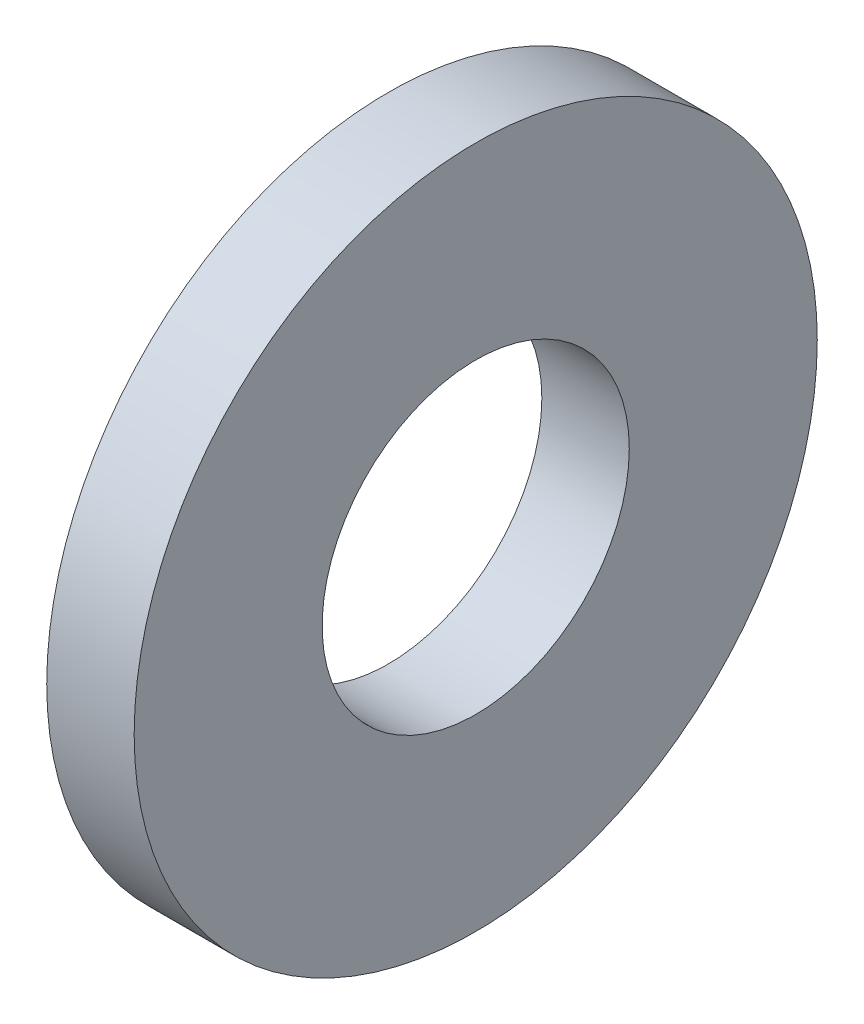
ISO-10303-21;
HEADER;
FILE_DESCRIPTION(('STEP AP214'),'2;1');
FILE_NAME('part.step','',(''),(''),'','','');
FILE_SCHEMA(('AUTOMOTIVE_DESIGN { 1 0 10303 214 1 1 1 1 }'));
ENDSEC;
DATA;
#1=APPLICATION_CONTEXT('core data for automotive mechanical design processes');
#2=APPLICATION_PROTOCOL_DEFINITION('international standard','automotive_design',2000,#1);
#3=PRODUCT_CONTEXT('',#1,'mechanical');
#4=PRODUCT('Part','Part','',(#3));
#5=PRODUCT_RELATED_PRODUCT_CATEGORY('part','',(#4));
#6=PRODUCT_DEFINITION_FORMATION('','',#4);
#7=PRODUCT_DEFINITION_CONTEXT('part definition',#1,'design');
#8=PRODUCT_DEFINITION('design','',#6,#7);
#9=PRODUCT_DEFINITION_SHAPE('','',#8);
#10=(LENGTH_UNIT() NAMED_UNIT(*) SI_UNIT(.MILLI.,.METRE.));
#11=(NAMED_UNIT(*) PLANE_ANGLE_UNIT() SI_UNIT($,.RADIAN.));
#12=(NAMED_UNIT(*) SI_UNIT($,.STERADIAN.) SOLID_ANGLE_UNIT());
#13=UNCERTAINTY_MEASURE_WITH_UNIT(LENGTH_MEASURE(1.E-05),#10,'distance_accuracy_value','');
#14=(GEOMETRIC_REPRESENTATION_CONTEXT(3) GLOBAL_UNCERTAINTY_ASSIGNED_CONTEXT((#13)) GLOBAL_UNIT_ASSIGNED_CONTEXT((#10,
#11,#12)) REPRESENTATION_CONTEXT('',''));
#15=CARTESIAN_POINT('',(0.,0.,0.));
#16=DIRECTION('',(0.,0.,1.));
#17=DIRECTION('',(1.,0.,0.));
#18=AXIS2_PLACEMENT_3D('',#15,#16,#17);
#19=CARTESIAN_POINT('',(2.032,0.,0.));
#20=DIRECTION('',(1.,0.,0.));
#21=DIRECTION('',(0.,0.,-1.));
#22=AXIS2_PLACEMENT_3D('',#19,#20,#21);
#23=PLANE('',#22);
#24=CARTESIAN_POINT('',(2.032,0.,0.));
#25=DIRECTION('',(1.,0.,0.));
#26=DIRECTION('',(0.,0.,-1.));
#27=AXIS2_PLACEMENT_3D('',#24,#25,#26);
#28=CIRCLE('',#27,7.9375);
#29=CARTESIAN_POINT('',(2.032,0.,-7.9375));
#30=VERTEX_POINT('',#29);
#31=EDGE_CURVE('E10',#30,#30,#28,.T.);
#32=ORIENTED_EDGE('',*,*,#31,.T.);
#33=EDGE_LOOP('',(#32));
#34=FACE_BOUND('',#33,.T.);
#35=CARTESIAN_POINT('',(2.032,0.,0.));
#36=DIRECTION('',(1.,0.,0.));
#37=DIRECTION('',(0.,0.,-1.));
#38=AXIS2_PLACEMENT_3D('',#35,#36,#37);
#39=CIRCLE('',#38,3.5687);
#40=CARTESIAN_POINT('',(2.032,0.,-3.5687));
#41=VERTEX_POINT('',#40);
#42=EDGE_CURVE('E41',#41,#41,#39,.T.);
#43=ORIENTED_EDGE('',*,*,#42,.F.);
#44=EDGE_LOOP('',(#43));
#45=FACE_BOUND('',#44,.T.);
#46=ADVANCED_FACE('F30',(#34,#45),#23,.T.);
#47=CARTESIAN_POINT('',(0.,0.,0.));
#48=DIRECTION('',(1.,0.,0.));
#49=DIRECTION('',(0.,0.,-1.));
#50=AXIS2_PLACEMENT_3D('',#47,#48,#49);
#51=PLANE('',#50);
#52=CARTESIAN_POINT('',(0.,0.,0.));
#53=DIRECTION('',(1.,0.,0.));
#54=DIRECTION('',(0.,0.,-1.));
#55=AXIS2_PLACEMENT_3D('',#52,#53,#54);
#56=CIRCLE('',#55,7.9375);
#57=CARTESIAN_POINT('',(0.,0.,-7.9375));
#58=VERTEX_POINT('',#57);
#59=EDGE_CURVE('E34',#58,#58,#56,.T.);
#60=ORIENTED_EDGE('',*,*,#59,.F.);
#61=EDGE_LOOP('',(#60));
#62=FACE_BOUND('',#61,.T.);
#63=CARTESIAN_POINT('',(0.,0.,0.));
#64=DIRECTION('',(1.,0.,0.));
#65=DIRECTION('',(0.,0.,-1.));
#66=AXIS2_PLACEMENT_3D('',#63,#64,#65);
#67=CIRCLE('',#66,3.5687);
#68=CARTESIAN_POINT('',(0.,0.,-3.5687));
#69=VERTEX_POINT('',#68);
#70=EDGE_CURVE('E43',#69,#69,#67,.T.);
#71=ORIENTED_EDGE('',*,*,#70,.T.);
#72=EDGE_LOOP('',(#71));
#73=FACE_BOUND('',#72,.T.);
#74=ADVANCED_FACE('F53',(#62,#73),#51,.F.);
#75=CARTESIAN_POINT('',(2.032,0.,0.));
#76=DIRECTION('',(-1.,0.,0.));
#77=DIRECTION('',(0.,0.,1.));
#78=AXIS2_PLACEMENT_3D('',#75,#76,#77);
#79=CYLINDRICAL_SURFACE('',#78,7.9375);
#80=ORIENTED_EDGE('',*,*,#31,.F.);
#81=EDGE_LOOP('',(#80));
#82=FACE_BOUND('',#81,.T.);
#83=ORIENTED_EDGE('',*,*,#59,.T.);
#84=EDGE_LOOP('',(#83));
#85=FACE_BOUND('',#84,.T.);
#86=ADVANCED_FACE('F32',(#82,#85),#79,.T.);
#87=CARTESIAN_POINT('',(2.032,0.,0.));
#88=DIRECTION('',(-1.,0.,0.));
#89=DIRECTION('',(0.,0.,1.));
#90=AXIS2_PLACEMENT_3D('',#87,#88,#89);
#91=CYLINDRICAL_SURFACE('',#90,3.5687);
#92=ORIENTED_EDGE('',*,*,#42,.T.);
#93=EDGE_LOOP('',(#92));
#94=FACE_BOUND('',#93,.T.);
#95=ORIENTED_EDGE('',*,*,#70,.F.);
#96=EDGE_LOOP('',(#95));
#97=FACE_BOUND('',#96,.T.);
#98=ADVANCED_FACE('F49',(#94,#97),#91,.F.);
#99=CLOSED_SHELL('',(#46,#74,#86,#98));
#100=MANIFOLD_SOLID_BREP('B2',#99);
#101=ADVANCED_BREP_SHAPE_REPRESENTATION('',(#18,#100),#14);
#102=SHAPE_DEFINITION_REPRESENTATION(#9,#101);
ENDSEC;
END-ISO-10303-21;
